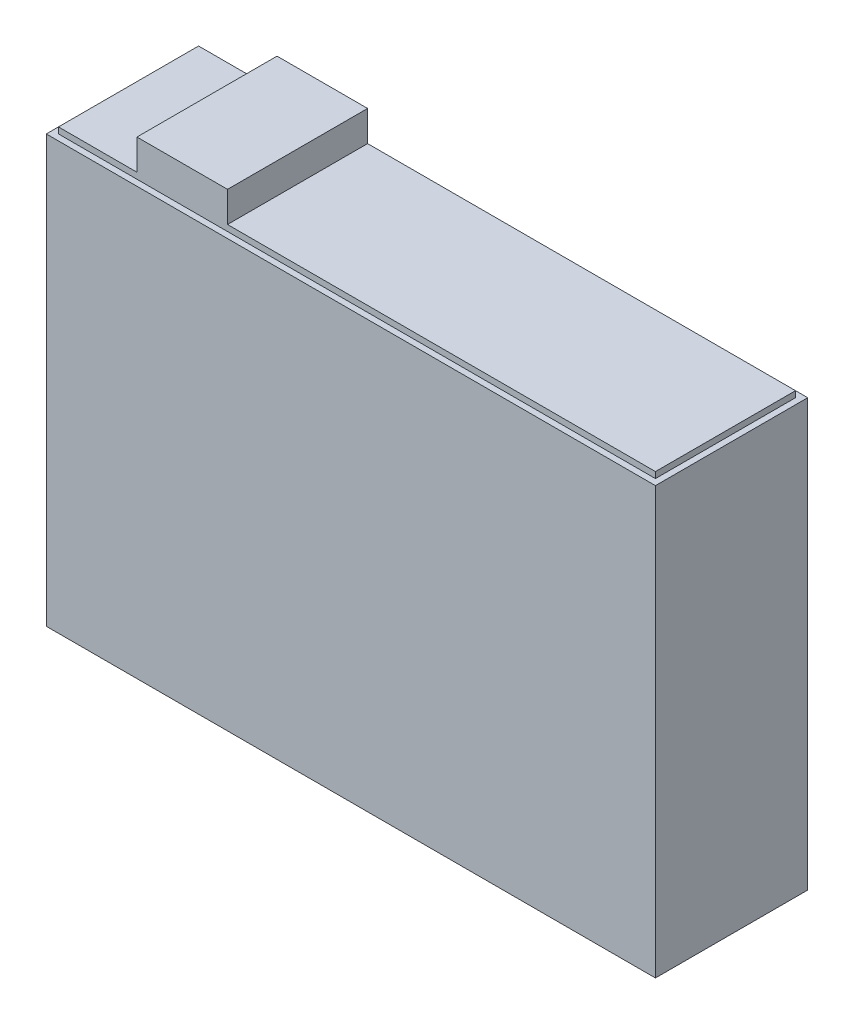
ISO-10303-21;
HEADER;
FILE_DESCRIPTION(('STEP AP214'),'2;1');
FILE_NAME('part.step','',(''),(''),'','','');
FILE_SCHEMA(('AUTOMOTIVE_DESIGN { 1 0 10303 214 1 1 1 1 }'));
ENDSEC;
DATA;
#1=APPLICATION_CONTEXT('core data for automotive mechanical design processes');
#2=APPLICATION_PROTOCOL_DEFINITION('international standard','automotive_design',2000,#1);
#3=PRODUCT_CONTEXT('',#1,'mechanical');
#4=PRODUCT('Part','Part','',(#3));
#5=PRODUCT_RELATED_PRODUCT_CATEGORY('part','',(#4));
#6=PRODUCT_DEFINITION_FORMATION('','',#4);
#7=PRODUCT_DEFINITION_CONTEXT('part definition',#1,'design');
#8=PRODUCT_DEFINITION('design','',#6,#7);
#9=PRODUCT_DEFINITION_SHAPE('','',#8);
#10=(LENGTH_UNIT() NAMED_UNIT(*) SI_UNIT(.MILLI.,.METRE.));
#11=(NAMED_UNIT(*) PLANE_ANGLE_UNIT() SI_UNIT($,.RADIAN.));
#12=(NAMED_UNIT(*) SI_UNIT($,.STERADIAN.) SOLID_ANGLE_UNIT());
#13=UNCERTAINTY_MEASURE_WITH_UNIT(LENGTH_MEASURE(1.E-05),#10,'distance_accuracy_value','');
#14=(GEOMETRIC_REPRESENTATION_CONTEXT(3) GLOBAL_UNCERTAINTY_ASSIGNED_CONTEXT((#13)) GLOBAL_UNIT_ASSIGNED_CONTEXT((#10,
#11,#12)) REPRESENTATION_CONTEXT('',''));
#15=CARTESIAN_POINT('',(0.,0.,0.));
#16=DIRECTION('',(0.,0.,1.));
#17=DIRECTION('',(1.,0.,0.));
#18=AXIS2_PLACEMENT_3D('',#15,#16,#17);
#19=CARTESIAN_POINT('',(-4.9,7.1,-1.15));
#20=DIRECTION('',(0.,1.,0.));
#21=DIRECTION('',(0.,0.,1.));
#22=AXIS2_PLACEMENT_3D('',#19,#20,#21);
#23=PLANE('',#22);
#24=DIRECTION('',(0.,0.,1.));
#25=VECTOR('',#24,1.);
#26=CARTESIAN_POINT('',(-3.61185808520759,7.1,-1.15));
#27=LINE('',#26,#25);
#28=CARTESIAN_POINT('',(-3.61185808520759,7.1,-1.15));
#29=VERTEX_POINT('',#28);
#30=CARTESIAN_POINT('',(-3.61185808520759,7.1,1.15));
#31=VERTEX_POINT('',#30);
#32=EDGE_CURVE('E148',#29,#31,#27,.T.);
#33=ORIENTED_EDGE('',*,*,#32,.F.);
#34=DIRECTION('',(-1.,0.,0.));
#35=VECTOR('',#34,1.);
#36=CARTESIAN_POINT('',(4.9,7.1,-1.15));
#37=LINE('',#36,#35);
#38=CARTESIAN_POINT('',(-4.9,7.1,-1.15));
#39=VERTEX_POINT('',#38);
#40=EDGE_CURVE('E188',#29,#39,#37,.T.);
#41=ORIENTED_EDGE('',*,*,#40,.T.);
#42=DIRECTION('',(0.,0.,1.));
#43=VECTOR('',#42,1.);
#44=CARTESIAN_POINT('',(-4.9,7.1,-1.15));
#45=LINE('',#44,#43);
#46=CARTESIAN_POINT('',(-4.9,7.1,1.15));
#47=VERTEX_POINT('',#46);
#48=EDGE_CURVE('E194',#39,#47,#45,.T.);
#49=ORIENTED_EDGE('',*,*,#48,.T.);
#50=DIRECTION('',(1.,0.,0.));
#51=VECTOR('',#50,1.);
#52=CARTESIAN_POINT('',(-4.9,7.1,1.15));
#53=LINE('',#52,#51);
#54=EDGE_CURVE('E60',#47,#31,#53,.T.);
#55=ORIENTED_EDGE('',*,*,#54,.T.);
#56=EDGE_LOOP('',(#33,#41,#49,#55));
#57=FACE_BOUND('',#56,.T.);
#58=ADVANCED_FACE('F35',(#57),#23,.T.);
#59=CARTESIAN_POINT('',(-5.,7.,1.25));
#60=DIRECTION('',(0.,1.,0.));
#61=DIRECTION('',(0.,0.,1.));
#62=AXIS2_PLACEMENT_3D('',#59,#60,#61);
#63=PLANE('',#62);
#64=DIRECTION('',(0.,0.,1.));
#65=VECTOR('',#64,1.);
#66=CARTESIAN_POINT('',(-5.,7.,-1.25));
#67=LINE('',#66,#65);
#68=CARTESIAN_POINT('',(-5.,7.,-1.25));
#69=VERTEX_POINT('',#68);
#70=CARTESIAN_POINT('',(-5.,7.,1.25));
#71=VERTEX_POINT('',#70);
#72=EDGE_CURVE('E215',#69,#71,#67,.T.);
#73=ORIENTED_EDGE('',*,*,#72,.T.);
#74=DIRECTION('',(1.,0.,0.));
#75=VECTOR('',#74,1.);
#76=CARTESIAN_POINT('',(-5.,7.,1.25));
#77=LINE('',#76,#75);
#78=CARTESIAN_POINT('',(5.,7.,1.25));
#79=VERTEX_POINT('',#78);
#80=EDGE_CURVE('E218',#71,#79,#77,.T.);
#81=ORIENTED_EDGE('',*,*,#80,.T.);
#82=DIRECTION('',(0.,0.,-1.));
#83=VECTOR('',#82,1.);
#84=CARTESIAN_POINT('',(5.,7.,-1.25));
#85=LINE('',#84,#83);
#86=CARTESIAN_POINT('',(5.,7.,-1.25));
#87=VERTEX_POINT('',#86);
#88=EDGE_CURVE('E221',#79,#87,#85,.T.);
#89=ORIENTED_EDGE('',*,*,#88,.T.);
#90=DIRECTION('',(-1.,0.,0.));
#91=VECTOR('',#90,1.);
#92=CARTESIAN_POINT('',(-5.,7.,-1.25));
#93=LINE('',#92,#91);
#94=EDGE_CURVE('E223',#87,#69,#93,.T.);
#95=ORIENTED_EDGE('',*,*,#94,.T.);
#96=EDGE_LOOP('',(#73,#81,#89,#95));
#97=FACE_BOUND('',#96,.T.);
#98=DIRECTION('',(0.,0.,1.));
#99=VECTOR('',#98,1.);
#100=CARTESIAN_POINT('',(-4.9,7.,-1.15));
#101=LINE('',#100,#99);
#102=CARTESIAN_POINT('',(-4.9,7.,-1.15));
#103=VERTEX_POINT('',#102);
#104=CARTESIAN_POINT('',(-4.9,7.,1.15));
#105=VERTEX_POINT('',#104);
#106=EDGE_CURVE('E152',#103,#105,#101,.T.);
#107=ORIENTED_EDGE('',*,*,#106,.F.);
#108=DIRECTION('',(-1.,0.,0.));
#109=VECTOR('',#108,1.);
#110=CARTESIAN_POINT('',(4.9,7.,-1.15));
#111=LINE('',#110,#109);
#112=CARTESIAN_POINT('',(4.9,7.,-1.15));
#113=VERTEX_POINT('',#112);
#114=EDGE_CURVE('E149',#113,#103,#111,.T.);
#115=ORIENTED_EDGE('',*,*,#114,.F.);
#116=DIRECTION('',(0.,0.,-1.));
#117=VECTOR('',#116,1.);
#118=CARTESIAN_POINT('',(4.9,7.,1.15));
#119=LINE('',#118,#117);
#120=CARTESIAN_POINT('',(4.9,7.,1.15));
#121=VERTEX_POINT('',#120);
#122=EDGE_CURVE('E192',#121,#113,#119,.T.);
#123=ORIENTED_EDGE('',*,*,#122,.F.);
#124=DIRECTION('',(1.,0.,0.));
#125=VECTOR('',#124,1.);
#126=CARTESIAN_POINT('',(-4.9,7.,1.15));
#127=LINE('',#126,#125);
#128=EDGE_CURVE('E196',#105,#121,#127,.T.);
#129=ORIENTED_EDGE('',*,*,#128,.F.);
#130=EDGE_LOOP('',(#107,#115,#123,#129));
#131=FACE_BOUND('',#130,.T.);
#132=ADVANCED_FACE('F258',(#97,#131),#63,.T.);
#133=CARTESIAN_POINT('',(-5.,7.,-1.25));
#134=DIRECTION('',(1.,0.,0.));
#135=DIRECTION('',(0.,0.,-1.));
#136=AXIS2_PLACEMENT_3D('',#133,#134,#135);
#137=PLANE('',#136);
#138=DIRECTION('',(0.,0.,1.));
#139=VECTOR('',#138,1.);
#140=CARTESIAN_POINT('',(-5.,0.,-1.25));
#141=LINE('',#140,#139);
#142=CARTESIAN_POINT('',(-5.,0.,-1.25));
#143=VERTEX_POINT('',#142);
#144=CARTESIAN_POINT('',(-5.,0.,1.25));
#145=VERTEX_POINT('',#144);
#146=EDGE_CURVE('E214',#143,#145,#141,.T.);
#147=ORIENTED_EDGE('',*,*,#146,.T.);
#148=DIRECTION('',(0.,-1.,0.));
#149=VECTOR('',#148,1.);
#150=CARTESIAN_POINT('',(-5.,7.,1.25));
#151=LINE('',#150,#149);
#152=EDGE_CURVE('E11',#71,#145,#151,.T.);
#153=ORIENTED_EDGE('',*,*,#152,.F.);
#154=ORIENTED_EDGE('',*,*,#72,.F.);
#155=DIRECTION('',(0.,-1.,0.));
#156=VECTOR('',#155,1.);
#157=CARTESIAN_POINT('',(-5.,7.,-1.25));
#158=LINE('',#157,#156);
#159=EDGE_CURVE('E225',#69,#143,#158,.T.);
#160=ORIENTED_EDGE('',*,*,#159,.T.);
#161=EDGE_LOOP('',(#147,#153,#154,#160));
#162=FACE_BOUND('',#161,.T.);
#163=ADVANCED_FACE('F37',(#162),#137,.F.);
#164=CARTESIAN_POINT('',(-5.,7.,1.25));
#165=DIRECTION('',(0.,0.,-1.));
#166=DIRECTION('',(-1.,0.,0.));
#167=AXIS2_PLACEMENT_3D('',#164,#165,#166);
#168=PLANE('',#167);
#169=DIRECTION('',(1.,0.,0.));
#170=VECTOR('',#169,1.);
#171=CARTESIAN_POINT('',(-5.,0.,1.25));
#172=LINE('',#171,#170);
#173=CARTESIAN_POINT('',(5.,0.,1.25));
#174=VERTEX_POINT('',#173);
#175=EDGE_CURVE('E228',#145,#174,#172,.T.);
#176=ORIENTED_EDGE('',*,*,#175,.T.);
#177=DIRECTION('',(0.,-1.,0.));
#178=VECTOR('',#177,1.);
#179=CARTESIAN_POINT('',(5.,7.,1.25));
#180=LINE('',#179,#178);
#181=EDGE_CURVE('E44',#79,#174,#180,.T.);
#182=ORIENTED_EDGE('',*,*,#181,.F.);
#183=ORIENTED_EDGE('',*,*,#80,.F.);
#184=ORIENTED_EDGE('',*,*,#152,.T.);
#185=EDGE_LOOP('',(#176,#182,#183,#184));
#186=FACE_BOUND('',#185,.T.);
#187=ADVANCED_FACE('F260',(#186),#168,.F.);
#188=CARTESIAN_POINT('',(5.,7.,-1.25));
#189=DIRECTION('',(-1.,0.,0.));
#190=DIRECTION('',(0.,0.,1.));
#191=AXIS2_PLACEMENT_3D('',#188,#189,#190);
#192=PLANE('',#191);
#193=DIRECTION('',(0.,0.,-1.));
#194=VECTOR('',#193,1.);
#195=CARTESIAN_POINT('',(5.,0.,-1.25));
#196=LINE('',#195,#194);
#197=CARTESIAN_POINT('',(5.,0.,-1.25));
#198=VERTEX_POINT('',#197);
#199=EDGE_CURVE('E230',#174,#198,#196,.T.);
#200=ORIENTED_EDGE('',*,*,#199,.T.);
#201=DIRECTION('',(0.,-1.,0.));
#202=VECTOR('',#201,1.);
#203=CARTESIAN_POINT('',(5.,7.,-1.25));
#204=LINE('',#203,#202);
#205=EDGE_CURVE('E235',#87,#198,#204,.T.);
#206=ORIENTED_EDGE('',*,*,#205,.F.);
#207=ORIENTED_EDGE('',*,*,#88,.F.);
#208=ORIENTED_EDGE('',*,*,#181,.T.);
#209=EDGE_LOOP('',(#200,#206,#207,#208));
#210=FACE_BOUND('',#209,.T.);
#211=ADVANCED_FACE('F243',(#210),#192,.F.);
#212=CARTESIAN_POINT('',(-5.,7.,-1.25));
#213=DIRECTION('',(0.,0.,1.));
#214=DIRECTION('',(1.,0.,0.));
#215=AXIS2_PLACEMENT_3D('',#212,#213,#214);
#216=PLANE('',#215);
#217=DIRECTION('',(-1.,0.,0.));
#218=VECTOR('',#217,1.);
#219=CARTESIAN_POINT('',(-5.,0.,-1.25));
#220=LINE('',#219,#218);
#221=EDGE_CURVE('E219',#198,#143,#220,.T.);
#222=ORIENTED_EDGE('',*,*,#221,.T.);
#223=ORIENTED_EDGE('',*,*,#159,.F.);
#224=ORIENTED_EDGE('',*,*,#94,.F.);
#225=ORIENTED_EDGE('',*,*,#205,.T.);
#226=EDGE_LOOP('',(#222,#223,#224,#225));
#227=FACE_BOUND('',#226,.T.);
#228=ADVANCED_FACE('F252',(#227),#216,.F.);
#229=CARTESIAN_POINT('',(-5.,0.,1.25));
#230=DIRECTION('',(0.,1.,0.));
#231=DIRECTION('',(0.,0.,1.));
#232=AXIS2_PLACEMENT_3D('',#229,#230,#231);
#233=PLANE('',#232);
#234=ORIENTED_EDGE('',*,*,#146,.F.);
#235=ORIENTED_EDGE('',*,*,#221,.F.);
#236=ORIENTED_EDGE('',*,*,#199,.F.);
#237=ORIENTED_EDGE('',*,*,#175,.F.);
#238=EDGE_LOOP('',(#234,#235,#236,#237));
#239=FACE_BOUND('',#238,.T.);
#240=ADVANCED_FACE('F249',(#239),#233,.F.);
#241=CARTESIAN_POINT('',(4.9,7.1,-1.15));
#242=DIRECTION('',(0.,0.,1.));
#243=DIRECTION('',(1.,0.,0.));
#244=AXIS2_PLACEMENT_3D('',#241,#242,#243);
#245=PLANE('',#244);
#246=ORIENTED_EDGE('',*,*,#114,.T.);
#247=DIRECTION('',(0.,-1.,0.));
#248=VECTOR('',#247,1.);
#249=CARTESIAN_POINT('',(-4.9,7.1,-1.15));
#250=LINE('',#249,#248);
#251=EDGE_CURVE('E189',#39,#103,#250,.T.);
#252=ORIENTED_EDGE('',*,*,#251,.F.);
#253=ORIENTED_EDGE('',*,*,#40,.F.);
#254=DIRECTION('',(0.,-1.,0.));
#255=VECTOR('',#254,1.);
#256=CARTESIAN_POINT('',(-3.61185808520759,7.6,-1.15));
#257=LINE('',#256,#255);
#258=CARTESIAN_POINT('',(-3.61185808520759,7.6,-1.15));
#259=VERTEX_POINT('',#258);
#260=EDGE_CURVE('E162',#259,#29,#257,.T.);
#261=ORIENTED_EDGE('',*,*,#260,.F.);
#262=DIRECTION('',(-1.,0.,0.));
#263=VECTOR('',#262,1.);
#264=CARTESIAN_POINT('',(-3.61185808520759,7.6,-1.15));
#265=LINE('',#264,#263);
#266=CARTESIAN_POINT('',(-2.12484844729488,7.6,-1.15));
#267=VERTEX_POINT('',#266);
#268=EDGE_CURVE('E142',#267,#259,#265,.T.);
#269=ORIENTED_EDGE('',*,*,#268,.F.);
#270=DIRECTION('',(0.,-1.,0.));
#271=VECTOR('',#270,1.);
#272=CARTESIAN_POINT('',(-2.12484844729488,7.6,-1.15));
#273=LINE('',#272,#271);
#274=CARTESIAN_POINT('',(-2.12484844729488,7.1,-1.15));
#275=VERTEX_POINT('',#274);
#276=EDGE_CURVE('E154',#267,#275,#273,.T.);
#277=ORIENTED_EDGE('',*,*,#276,.T.);
#278=CARTESIAN_POINT('',(4.9,7.1,-1.15));
#279=VERTEX_POINT('',#278);
#280=EDGE_CURVE('E191',#279,#275,#37,.T.);
#281=ORIENTED_EDGE('',*,*,#280,.F.);
#282=DIRECTION('',(0.,-1.,0.));
#283=VECTOR('',#282,1.);
#284=CARTESIAN_POINT('',(4.9,7.1,-1.15));
#285=LINE('',#284,#283);
#286=EDGE_CURVE('E202',#279,#113,#285,.T.);
#287=ORIENTED_EDGE('',*,*,#286,.T.);
#288=EDGE_LOOP('',(#246,#252,#253,#261,#269,#277,#281,#287));
#289=FACE_BOUND('',#288,.T.);
#290=ADVANCED_FACE('F185',(#289),#245,.F.);
#291=CARTESIAN_POINT('',(-4.9,7.1,-1.15));
#292=DIRECTION('',(1.,0.,0.));
#293=DIRECTION('',(0.,0.,-1.));
#294=AXIS2_PLACEMENT_3D('',#291,#292,#293);
#295=PLANE('',#294);
#296=ORIENTED_EDGE('',*,*,#106,.T.);
#297=DIRECTION('',(0.,-1.,0.));
#298=VECTOR('',#297,1.);
#299=CARTESIAN_POINT('',(-4.9,7.1,1.15));
#300=LINE('',#299,#298);
#301=EDGE_CURVE('E210',#47,#105,#300,.T.);
#302=ORIENTED_EDGE('',*,*,#301,.F.);
#303=ORIENTED_EDGE('',*,*,#48,.F.);
#304=ORIENTED_EDGE('',*,*,#251,.T.);
#305=EDGE_LOOP('',(#296,#302,#303,#304));
#306=FACE_BOUND('',#305,.T.);
#307=ADVANCED_FACE('F286',(#306),#295,.F.);
#308=CARTESIAN_POINT('',(-4.9,7.1,1.15));
#309=DIRECTION('',(0.,0.,-1.));
#310=DIRECTION('',(-1.,0.,0.));
#311=AXIS2_PLACEMENT_3D('',#308,#309,#310);
#312=PLANE('',#311);
#313=ORIENTED_EDGE('',*,*,#128,.T.);
#314=DIRECTION('',(0.,-1.,0.));
#315=VECTOR('',#314,1.);
#316=CARTESIAN_POINT('',(4.9,7.1,1.15));
#317=LINE('',#316,#315);
#318=CARTESIAN_POINT('',(4.9,7.1,1.15));
#319=VERTEX_POINT('',#318);
#320=EDGE_CURVE('E208',#319,#121,#317,.T.);
#321=ORIENTED_EDGE('',*,*,#320,.F.);
#322=CARTESIAN_POINT('',(-2.12484844729488,7.1,1.15));
#323=VERTEX_POINT('',#322);
#324=EDGE_CURVE('E174',#323,#319,#53,.T.);
#325=ORIENTED_EDGE('',*,*,#324,.F.);
#326=DIRECTION('',(0.,-1.,0.));
#327=VECTOR('',#326,1.);
#328=CARTESIAN_POINT('',(-2.12484844729488,7.6,1.15));
#329=LINE('',#328,#327);
#330=CARTESIAN_POINT('',(-2.12484844729488,7.6,1.15));
#331=VERTEX_POINT('',#330);
#332=EDGE_CURVE('E133',#331,#323,#329,.T.);
#333=ORIENTED_EDGE('',*,*,#332,.F.);
#334=DIRECTION('',(1.,0.,0.));
#335=VECTOR('',#334,1.);
#336=CARTESIAN_POINT('',(-3.61185808520759,7.6,1.15));
#337=LINE('',#336,#335);
#338=CARTESIAN_POINT('',(-3.61185808520759,7.6,1.15));
#339=VERTEX_POINT('',#338);
#340=EDGE_CURVE('E125',#339,#331,#337,.T.);
#341=ORIENTED_EDGE('',*,*,#340,.F.);
#342=DIRECTION('',(0.,-1.,0.));
#343=VECTOR('',#342,1.);
#344=CARTESIAN_POINT('',(-3.61185808520759,7.6,1.15));
#345=LINE('',#344,#343);
#346=EDGE_CURVE('E130',#339,#31,#345,.T.);
#347=ORIENTED_EDGE('',*,*,#346,.T.);
#348=ORIENTED_EDGE('',*,*,#54,.F.);
#349=ORIENTED_EDGE('',*,*,#301,.T.);
#350=EDGE_LOOP('',(#313,#321,#325,#333,#341,#347,#348,#349));
#351=FACE_BOUND('',#350,.T.);
#352=ADVANCED_FACE('F128',(#351),#312,.F.);
#353=CARTESIAN_POINT('',(4.9,7.1,1.15));
#354=DIRECTION('',(-1.,0.,0.));
#355=DIRECTION('',(0.,0.,1.));
#356=AXIS2_PLACEMENT_3D('',#353,#354,#355);
#357=PLANE('',#356);
#358=ORIENTED_EDGE('',*,*,#122,.T.);
#359=ORIENTED_EDGE('',*,*,#286,.F.);
#360=DIRECTION('',(0.,0.,-1.));
#361=VECTOR('',#360,1.);
#362=CARTESIAN_POINT('',(4.9,7.1,1.15));
#363=LINE('',#362,#361);
#364=EDGE_CURVE('E198',#319,#279,#363,.T.);
#365=ORIENTED_EDGE('',*,*,#364,.F.);
#366=ORIENTED_EDGE('',*,*,#320,.T.);
#367=EDGE_LOOP('',(#358,#359,#365,#366));
#368=FACE_BOUND('',#367,.T.);
#369=ADVANCED_FACE('F277',(#368),#357,.F.);
#370=DIRECTION('',(0.,0.,-1.));
#371=VECTOR('',#370,1.);
#372=CARTESIAN_POINT('',(-2.12484844729488,7.1,-1.15));
#373=LINE('',#372,#371);
#374=EDGE_CURVE('E52',#323,#275,#373,.T.);
#375=ORIENTED_EDGE('',*,*,#374,.F.);
#376=ORIENTED_EDGE('',*,*,#324,.T.);
#377=ORIENTED_EDGE('',*,*,#364,.T.);
#378=ORIENTED_EDGE('',*,*,#280,.T.);
#379=EDGE_LOOP('',(#375,#376,#377,#378));
#380=FACE_BOUND('',#379,.T.);
#381=ADVANCED_FACE('F269',(#380),#23,.T.);
#382=CARTESIAN_POINT('',(-3.61185808520759,7.6,-1.15));
#383=DIRECTION('',(1.,0.,0.));
#384=DIRECTION('',(0.,0.,-1.));
#385=AXIS2_PLACEMENT_3D('',#382,#383,#384);
#386=PLANE('',#385);
#387=ORIENTED_EDGE('',*,*,#32,.T.);
#388=ORIENTED_EDGE('',*,*,#346,.F.);
#389=DIRECTION('',(0.,0.,1.));
#390=VECTOR('',#389,1.);
#391=CARTESIAN_POINT('',(-3.61185808520759,7.6,-1.15));
#392=LINE('',#391,#390);
#393=EDGE_CURVE('E137',#259,#339,#392,.T.);
#394=ORIENTED_EDGE('',*,*,#393,.F.);
#395=ORIENTED_EDGE('',*,*,#260,.T.);
#396=EDGE_LOOP('',(#387,#388,#394,#395));
#397=FACE_BOUND('',#396,.T.);
#398=ADVANCED_FACE('F147',(#397),#386,.F.);
#399=CARTESIAN_POINT('',(-2.12484844729488,7.6,-1.15));
#400=DIRECTION('',(-1.,0.,0.));
#401=DIRECTION('',(0.,0.,1.));
#402=AXIS2_PLACEMENT_3D('',#399,#400,#401);
#403=PLANE('',#402);
#404=ORIENTED_EDGE('',*,*,#374,.T.);
#405=ORIENTED_EDGE('',*,*,#276,.F.);
#406=DIRECTION('',(0.,0.,-1.));
#407=VECTOR('',#406,1.);
#408=CARTESIAN_POINT('',(-2.12484844729488,7.6,-1.15));
#409=LINE('',#408,#407);
#410=EDGE_CURVE('E136',#331,#267,#409,.T.);
#411=ORIENTED_EDGE('',*,*,#410,.F.);
#412=ORIENTED_EDGE('',*,*,#332,.T.);
#413=EDGE_LOOP('',(#404,#405,#411,#412));
#414=FACE_BOUND('',#413,.T.);
#415=ADVANCED_FACE('F184',(#414),#403,.F.);
#416=CARTESIAN_POINT('',(-3.61185808520759,7.6,1.15));
#417=DIRECTION('',(0.,1.,0.));
#418=DIRECTION('',(0.,0.,1.));
#419=AXIS2_PLACEMENT_3D('',#416,#417,#418);
#420=PLANE('',#419);
#421=ORIENTED_EDGE('',*,*,#393,.T.);
#422=ORIENTED_EDGE('',*,*,#340,.T.);
#423=ORIENTED_EDGE('',*,*,#410,.T.);
#424=ORIENTED_EDGE('',*,*,#268,.T.);
#425=EDGE_LOOP('',(#421,#422,#423,#424));
#426=FACE_BOUND('',#425,.T.);
#427=ADVANCED_FACE('F140',(#426),#420,.T.);
#428=CLOSED_SHELL('',(#58,#132,#163,#187,#211,#228,#240,#290,#307,#352,#369,#381,#398,#415,#427));
#429=MANIFOLD_SOLID_BREP('B2',#428);
#430=ADVANCED_BREP_SHAPE_REPRESENTATION('',(#18,#429),#14);
#431=SHAPE_DEFINITION_REPRESENTATION(#9,#430);
ENDSEC;
END-ISO-10303-21;
